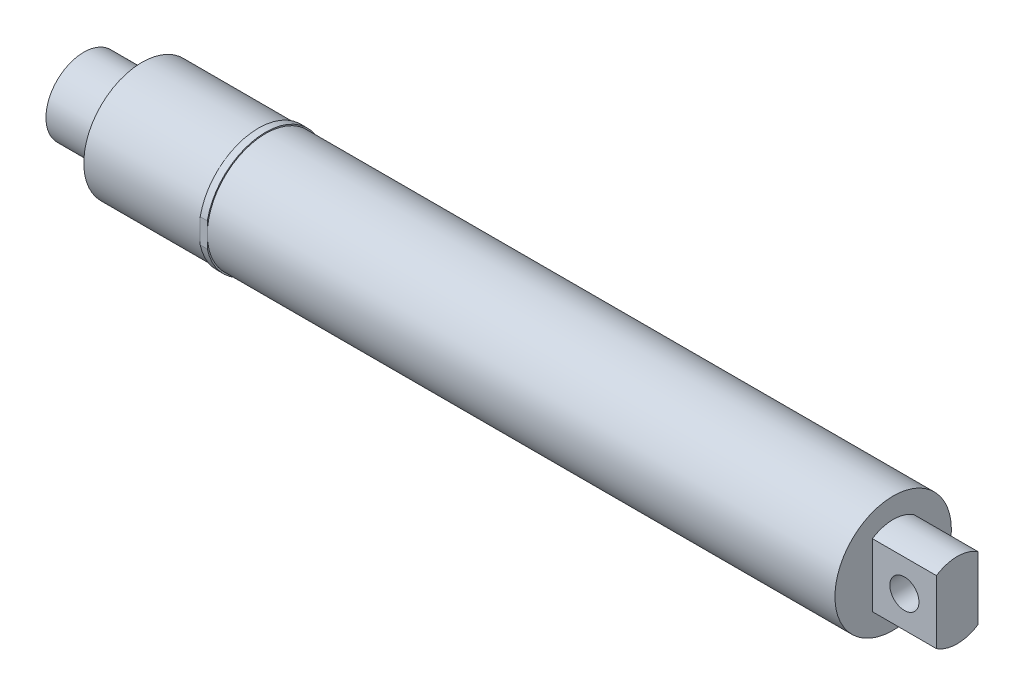
ISO-10303-21;
HEADER;
FILE_DESCRIPTION(('STEP AP214'),'2;1');
FILE_NAME('part.step','',(''),(''),'','','');
FILE_SCHEMA(('AUTOMOTIVE_DESIGN { 1 0 10303 214 1 1 1 1 }'));
ENDSEC;
DATA;
#1=APPLICATION_CONTEXT('core data for automotive mechanical design processes');
#2=APPLICATION_PROTOCOL_DEFINITION('international standard','automotive_design',2000,#1);
#3=PRODUCT_CONTEXT('',#1,'mechanical');
#4=PRODUCT('Part','Part','',(#3));
#5=PRODUCT_RELATED_PRODUCT_CATEGORY('part','',(#4));
#6=PRODUCT_DEFINITION_FORMATION('','',#4);
#7=PRODUCT_DEFINITION_CONTEXT('part definition',#1,'design');
#8=PRODUCT_DEFINITION('design','',#6,#7);
#9=PRODUCT_DEFINITION_SHAPE('','',#8);
#10=(LENGTH_UNIT() NAMED_UNIT(*) SI_UNIT(.MILLI.,.METRE.));
#11=(NAMED_UNIT(*) PLANE_ANGLE_UNIT() SI_UNIT($,.RADIAN.));
#12=(NAMED_UNIT(*) SI_UNIT($,.STERADIAN.) SOLID_ANGLE_UNIT());
#13=UNCERTAINTY_MEASURE_WITH_UNIT(LENGTH_MEASURE(1.E-05),#10,'distance_accuracy_value','');
#14=(GEOMETRIC_REPRESENTATION_CONTEXT(3) GLOBAL_UNCERTAINTY_ASSIGNED_CONTEXT((#13)) GLOBAL_UNIT_ASSIGNED_CONTEXT((#10,
#11,#12)) REPRESENTATION_CONTEXT('',''));
#15=CARTESIAN_POINT('',(0.,0.,0.));
#16=DIRECTION('',(0.,0.,1.));
#17=DIRECTION('',(1.,0.,0.));
#18=AXIS2_PLACEMENT_3D('',#15,#16,#17);
#19=CARTESIAN_POINT('',(0.,0.,12.7));
#20=DIRECTION('',(0.,0.,1.));
#21=DIRECTION('',(1.,0.,0.));
#22=AXIS2_PLACEMENT_3D('',#19,#20,#21);
#23=PLANE('',#22);
#24=DIRECTION('',(-1.,0.,0.));
#25=VECTOR('',#24,1.);
#26=CARTESIAN_POINT('',(102.362,-2.76845740193436,12.7));
#27=LINE('',#26,#25);
#28=CARTESIAN_POINT('',(39.6461242950851,-2.76845740193436,12.7));
#29=VERTEX_POINT('',#28);
#30=CARTESIAN_POINT('',(38.1,-2.76845740193436,12.7));
#31=VERTEX_POINT('',#30);
#32=EDGE_CURVE('E57',#29,#31,#27,.T.);
#33=ORIENTED_EDGE('',*,*,#32,.F.);
#34=DIRECTION('',(0.,1.,0.));
#35=VECTOR('',#34,1.);
#36=CARTESIAN_POINT('',(39.6461242950851,-12.4409828948511,12.7));
#37=LINE('',#36,#35);
#38=CARTESIAN_POINT('',(39.6461242950851,0.,12.7));
#39=VERTEX_POINT('',#38);
#40=EDGE_CURVE('E269',#29,#39,#37,.T.);
#41=ORIENTED_EDGE('',*,*,#40,.T.);
#42=CARTESIAN_POINT('',(39.6461242950851,2.57800782224224,12.7));
#43=VERTEX_POINT('',#42);
#44=EDGE_CURVE('E264',#39,#43,#37,.T.);
#45=ORIENTED_EDGE('',*,*,#44,.T.);
#46=DIRECTION('',(-1.,0.,0.));
#47=VECTOR('',#46,1.);
#48=CARTESIAN_POINT('',(64.262,2.57800782224224,12.7));
#49=LINE('',#48,#47);
#50=CARTESIAN_POINT('',(38.1,2.57800782224224,12.7));
#51=VERTEX_POINT('',#50);
#52=EDGE_CURVE('E288',#43,#51,#49,.T.);
#53=ORIENTED_EDGE('',*,*,#52,.T.);
#54=DIRECTION('',(0.,-1.,0.));
#55=VECTOR('',#54,1.);
#56=CARTESIAN_POINT('',(38.1,-12.4409828948511,12.7));
#57=LINE('',#56,#55);
#58=CARTESIAN_POINT('',(38.1,0.,12.7));
#59=VERTEX_POINT('',#58);
#60=EDGE_CURVE('E252',#51,#59,#57,.T.);
#61=ORIENTED_EDGE('',*,*,#60,.T.);
#62=EDGE_CURVE('E248',#59,#31,#57,.T.);
#63=ORIENTED_EDGE('',*,*,#62,.T.);
#64=EDGE_LOOP('',(#33,#41,#45,#53,#61,#63));
#65=FACE_BOUND('',#64,.T.);
#66=ADVANCED_FACE('F33',(#65),#23,.T.);
#67=CARTESIAN_POINT('',(39.6461242950851,-12.4409828948511,12.7));
#68=DIRECTION('',(-1.,0.,0.));
#69=DIRECTION('',(0.,0.,1.));
#70=AXIS2_PLACEMENT_3D('',#67,#68,#69);
#71=PLANE('',#70);
#72=DIRECTION('',(0.,1.,0.));
#73=VECTOR('',#72,1.);
#74=CARTESIAN_POINT('',(39.6461242950851,-12.4409828948511,-12.7));
#75=LINE('',#74,#73);
#76=CARTESIAN_POINT('',(39.6461242950851,0.,-12.7));
#77=VERTEX_POINT('',#76);
#78=CARTESIAN_POINT('',(39.6461242950851,2.57800782224224,-12.7));
#79=VERTEX_POINT('',#78);
#80=EDGE_CURVE('E265',#77,#79,#75,.T.);
#81=ORIENTED_EDGE('',*,*,#80,.T.);
#82=CARTESIAN_POINT('',(39.6461242950851,0.,0.));
#83=DIRECTION('',(-1.,0.,0.));
#84=DIRECTION('',(0.,0.,1.));
#85=AXIS2_PLACEMENT_3D('',#82,#83,#84);
#86=CIRCLE('',#85,12.9590171051489);
#87=EDGE_CURVE('E287',#43,#79,#86,.T.);
#88=ORIENTED_EDGE('',*,*,#87,.F.);
#89=ORIENTED_EDGE('',*,*,#44,.F.);
#90=CARTESIAN_POINT('',(39.6461242950851,0.,0.));
#91=DIRECTION('',(-1.,0.,0.));
#92=DIRECTION('',(0.,0.,1.));
#93=AXIS2_PLACEMENT_3D('',#90,#91,#92);
#94=CIRCLE('',#93,12.7);
#95=EDGE_CURVE('E169',#39,#77,#94,.T.);
#96=ORIENTED_EDGE('',*,*,#95,.T.);
#97=EDGE_LOOP('',(#81,#88,#89,#96));
#98=FACE_BOUND('',#97,.T.);
#99=ADVANCED_FACE('F285',(#98),#71,.F.);
#100=CARTESIAN_POINT('',(38.1,-12.4409828948511,12.7));
#101=DIRECTION('',(1.,0.,0.));
#102=DIRECTION('',(0.,0.,-1.));
#103=AXIS2_PLACEMENT_3D('',#100,#101,#102);
#104=PLANE('',#103);
#105=CARTESIAN_POINT('',(38.1,0.,0.));
#106=DIRECTION('',(1.,0.,0.));
#107=DIRECTION('',(0.,0.,-1.));
#108=AXIS2_PLACEMENT_3D('',#105,#106,#107);
#109=CIRCLE('',#108,12.9590171051489);
#110=CARTESIAN_POINT('',(38.1,2.57800782224224,-12.7));
#111=VERTEX_POINT('',#110);
#112=EDGE_CURVE('E290',#111,#51,#109,.T.);
#113=ORIENTED_EDGE('',*,*,#112,.F.);
#114=DIRECTION('',(0.,-1.,0.));
#115=VECTOR('',#114,1.);
#116=CARTESIAN_POINT('',(38.1,-12.4409828948511,-12.7));
#117=LINE('',#116,#115);
#118=CARTESIAN_POINT('',(38.1,0.,-12.7));
#119=VERTEX_POINT('',#118);
#120=EDGE_CURVE('E254',#111,#119,#117,.T.);
#121=ORIENTED_EDGE('',*,*,#120,.T.);
#122=CARTESIAN_POINT('',(38.1,0.,0.));
#123=DIRECTION('',(1.,0.,0.));
#124=DIRECTION('',(0.,0.,-1.));
#125=AXIS2_PLACEMENT_3D('',#122,#123,#124);
#126=CIRCLE('',#125,12.7);
#127=EDGE_CURVE('E164',#119,#59,#126,.T.);
#128=ORIENTED_EDGE('',*,*,#127,.T.);
#129=ORIENTED_EDGE('',*,*,#60,.F.);
#130=EDGE_LOOP('',(#113,#121,#128,#129));
#131=FACE_BOUND('',#130,.T.);
#132=ADVANCED_FACE('F251',(#131),#104,.F.);
#133=CARTESIAN_POINT('',(190.5,0.,0.));
#134=DIRECTION('',(-1.,0.,0.));
#135=DIRECTION('',(0.,0.,1.));
#136=AXIS2_PLACEMENT_3D('',#133,#134,#135);
#137=CYLINDRICAL_SURFACE('',#136,12.7);
#138=CARTESIAN_POINT('',(176.53,0.,0.));
#139=DIRECTION('',(1.,0.,0.));
#140=DIRECTION('',(0.,0.,-1.));
#141=AXIS2_PLACEMENT_3D('',#138,#139,#140);
#142=CIRCLE('',#141,12.7);
#143=CARTESIAN_POINT('',(176.53,0.,-12.7));
#144=VERTEX_POINT('',#143);
#145=EDGE_CURVE('E196',#144,#144,#142,.T.);
#146=ORIENTED_EDGE('',*,*,#145,.F.);
#147=EDGE_LOOP('',(#146));
#148=FACE_BOUND('',#147,.T.);
#149=CARTESIAN_POINT('',(12.7,0.,0.));
#150=DIRECTION('',(1.,0.,0.));
#151=DIRECTION('',(0.,0.,-1.));
#152=AXIS2_PLACEMENT_3D('',#149,#150,#151);
#153=CIRCLE('',#152,12.7);
#154=CARTESIAN_POINT('',(12.7,0.,-12.7));
#155=VERTEX_POINT('',#154);
#156=EDGE_CURVE('E211',#155,#155,#153,.T.);
#157=ORIENTED_EDGE('',*,*,#156,.T.);
#158=EDGE_LOOP('',(#157));
#159=FACE_BOUND('',#158,.T.);
#160=ORIENTED_EDGE('',*,*,#95,.F.);
#161=CARTESIAN_POINT('',(39.6461242950851,-12.4409828948511,2.5518512123599));
#162=VERTEX_POINT('',#161);
#163=EDGE_CURVE('E166',#162,#39,#94,.T.);
#164=ORIENTED_EDGE('',*,*,#163,.F.);
#165=DIRECTION('',(-1.,0.,0.));
#166=VECTOR('',#165,1.);
#167=CARTESIAN_POINT('',(190.5,-12.4409828948511,2.5518512123599));
#168=LINE('',#167,#166);
#169=CARTESIAN_POINT('',(38.1,-12.4409828948511,2.5518512123599));
#170=VERTEX_POINT('',#169);
#171=EDGE_CURVE('E42',#170,#162,#168,.F.);
#172=ORIENTED_EDGE('',*,*,#171,.F.);
#173=EDGE_CURVE('E165',#59,#170,#126,.T.);
#174=ORIENTED_EDGE('',*,*,#173,.F.);
#175=ORIENTED_EDGE('',*,*,#127,.F.);
#176=CARTESIAN_POINT('',(38.1,-12.4409828948511,-2.5518512123599));
#177=VERTEX_POINT('',#176);
#178=EDGE_CURVE('E158',#177,#119,#126,.T.);
#179=ORIENTED_EDGE('',*,*,#178,.F.);
#180=DIRECTION('',(-1.,0.,0.));
#181=VECTOR('',#180,1.);
#182=CARTESIAN_POINT('',(190.5,-12.4409828948511,-2.5518512123599));
#183=LINE('',#182,#181);
#184=CARTESIAN_POINT('',(39.6461242950851,-12.4409828948511,-2.5518512123599));
#185=VERTEX_POINT('',#184);
#186=EDGE_CURVE('E229',#185,#177,#183,.T.);
#187=ORIENTED_EDGE('',*,*,#186,.F.);
#188=EDGE_CURVE('E154',#77,#185,#94,.T.);
#189=ORIENTED_EDGE('',*,*,#188,.F.);
#190=EDGE_LOOP('',(#160,#164,#172,#174,#175,#179,#187,#189));
#191=FACE_BOUND('',#190,.T.);
#192=ADVANCED_FACE('F35',(#148,#159,#191),#137,.T.);
#193=CARTESIAN_POINT('',(170.18,0.,0.));
#194=DIRECTION('',(-1.,0.,0.));
#195=DIRECTION('',(0.,0.,1.));
#196=AXIS2_PLACEMENT_3D('',#193,#194,#195);
#197=CYLINDRICAL_SURFACE('',#196,2.54);
#198=CARTESIAN_POINT('',(0.,0.,0.));
#199=DIRECTION('',(-1.,0.,0.));
#200=DIRECTION('',(0.,0.,1.));
#201=AXIS2_PLACEMENT_3D('',#198,#199,#200);
#202=CIRCLE('',#201,2.54);
#203=CARTESIAN_POINT('',(0.,0.,2.54));
#204=VERTEX_POINT('',#203);
#205=EDGE_CURVE('E204',#204,#204,#202,.T.);
#206=ORIENTED_EDGE('',*,*,#205,.T.);
#207=EDGE_LOOP('',(#206));
#208=FACE_BOUND('',#207,.T.);
#209=CARTESIAN_POINT('',(38.1,0.,0.));
#210=DIRECTION('',(1.,0.,0.));
#211=DIRECTION('',(0.,0.,-1.));
#212=AXIS2_PLACEMENT_3D('',#209,#210,#211);
#213=CIRCLE('',#212,2.54);
#214=CARTESIAN_POINT('',(38.1,0.,-2.54));
#215=VERTEX_POINT('',#214);
#216=EDGE_CURVE('E223',#215,#215,#213,.F.);
#217=ORIENTED_EDGE('',*,*,#216,.F.);
#218=EDGE_LOOP('',(#217));
#219=FACE_BOUND('',#218,.T.);
#220=ADVANCED_FACE('F353',(#208,#219),#197,.F.);
#221=CARTESIAN_POINT('',(176.53,0.,0.));
#222=DIRECTION('',(1.,0.,0.));
#223=DIRECTION('',(0.,0.,-1.));
#224=AXIS2_PLACEMENT_3D('',#221,#222,#223);
#225=CYLINDRICAL_SURFACE('',#224,8.255);
#226=DIRECTION('',(1.,0.,0.));
#227=VECTOR('',#226,1.);
#228=CARTESIAN_POINT('',(176.53,-6.89903867691182,-4.53302220758675));
#229=LINE('',#228,#227);
#230=CARTESIAN_POINT('',(176.53,-6.89903867691182,-4.53302220758675));
#231=VERTEX_POINT('',#230);
#232=CARTESIAN_POINT('',(190.5,-6.89903867691182,-4.53302220758675));
#233=VERTEX_POINT('',#232);
#234=EDGE_CURVE('E180',#231,#233,#229,.T.);
#235=ORIENTED_EDGE('',*,*,#234,.T.);
#236=CARTESIAN_POINT('',(190.5,0.,0.));
#237=DIRECTION('',(1.,0.,0.));
#238=DIRECTION('',(0.,0.,-1.));
#239=AXIS2_PLACEMENT_3D('',#236,#237,#238);
#240=CIRCLE('',#239,8.255);
#241=CARTESIAN_POINT('',(190.5,-6.89903867691183,4.53302220758675));
#242=VERTEX_POINT('',#241);
#243=EDGE_CURVE('E207',#242,#233,#240,.T.);
#244=ORIENTED_EDGE('',*,*,#243,.F.);
#245=DIRECTION('',(1.,0.,0.));
#246=VECTOR('',#245,1.);
#247=CARTESIAN_POINT('',(176.53,-6.89903867691183,4.53302220758675));
#248=LINE('',#247,#246);
#249=CARTESIAN_POINT('',(176.53,-6.89903867691183,4.53302220758675));
#250=VERTEX_POINT('',#249);
#251=EDGE_CURVE('E187',#250,#242,#248,.T.);
#252=ORIENTED_EDGE('',*,*,#251,.F.);
#253=CARTESIAN_POINT('',(176.53,0.,0.));
#254=DIRECTION('',(1.,0.,0.));
#255=DIRECTION('',(0.,0.,-1.));
#256=AXIS2_PLACEMENT_3D('',#253,#254,#255);
#257=CIRCLE('',#256,8.255);
#258=EDGE_CURVE('E193',#250,#231,#257,.T.);
#259=ORIENTED_EDGE('',*,*,#258,.T.);
#260=EDGE_LOOP('',(#235,#244,#252,#259));
#261=FACE_BOUND('',#260,.T.);
#262=ADVANCED_FACE('F339',(#261),#225,.T.);
#263=CARTESIAN_POINT('',(12.7,0.,0.));
#264=DIRECTION('',(1.,0.,0.));
#265=DIRECTION('',(0.,0.,-1.));
#266=AXIS2_PLACEMENT_3D('',#263,#264,#265);
#267=PLANE('',#266);
#268=ORIENTED_EDGE('',*,*,#156,.F.);
#269=EDGE_LOOP('',(#268));
#270=FACE_BOUND('',#269,.T.);
#271=CARTESIAN_POINT('',(12.7,0.,0.));
#272=DIRECTION('',(1.,0.,0.));
#273=DIRECTION('',(0.,0.,-1.));
#274=AXIS2_PLACEMENT_3D('',#271,#272,#273);
#275=CIRCLE('',#274,8.255);
#276=CARTESIAN_POINT('',(12.7,0.,-8.255));
#277=VERTEX_POINT('',#276);
#278=EDGE_CURVE('E208',#277,#277,#275,.T.);
#279=ORIENTED_EDGE('',*,*,#278,.T.);
#280=EDGE_LOOP('',(#279));
#281=FACE_BOUND('',#280,.T.);
#282=ADVANCED_FACE('F357',(#270,#281),#267,.F.);
#283=CARTESIAN_POINT('',(12.7,0.,0.));
#284=DIRECTION('',(-1.,0.,0.));
#285=DIRECTION('',(0.,0.,1.));
#286=AXIS2_PLACEMENT_3D('',#283,#284,#285);
#287=CYLINDRICAL_SURFACE('',#286,8.255);
#288=ORIENTED_EDGE('',*,*,#278,.F.);
#289=EDGE_LOOP('',(#288));
#290=FACE_BOUND('',#289,.T.);
#291=CARTESIAN_POINT('',(0.,0.,0.));
#292=DIRECTION('',(1.,0.,0.));
#293=DIRECTION('',(0.,0.,-1.));
#294=AXIS2_PLACEMENT_3D('',#291,#292,#293);
#295=CIRCLE('',#294,8.255);
#296=CARTESIAN_POINT('',(0.,0.,-8.255));
#297=VERTEX_POINT('',#296);
#298=EDGE_CURVE('E203',#297,#297,#295,.T.);
#299=ORIENTED_EDGE('',*,*,#298,.T.);
#300=EDGE_LOOP('',(#299));
#301=FACE_BOUND('',#300,.T.);
#302=ADVANCED_FACE('F354',(#290,#301),#287,.T.);
#303=CARTESIAN_POINT('',(0.,0.,0.));
#304=DIRECTION('',(1.,0.,0.));
#305=DIRECTION('',(0.,0.,-1.));
#306=AXIS2_PLACEMENT_3D('',#303,#304,#305);
#307=PLANE('',#306);
#308=ORIENTED_EDGE('',*,*,#205,.F.);
#309=EDGE_LOOP('',(#308));
#310=FACE_BOUND('',#309,.T.);
#311=ORIENTED_EDGE('',*,*,#298,.F.);
#312=EDGE_LOOP('',(#311));
#313=FACE_BOUND('',#312,.T.);
#314=ADVANCED_FACE('F342',(#310,#313),#307,.F.);
#315=CARTESIAN_POINT('',(176.53,0.,0.));
#316=DIRECTION('',(1.,0.,0.));
#317=DIRECTION('',(0.,0.,-1.));
#318=AXIS2_PLACEMENT_3D('',#315,#316,#317);
#319=PLANE('',#318);
#320=ORIENTED_EDGE('',*,*,#258,.F.);
#321=DIRECTION('',(0.,1.,0.));
#322=VECTOR('',#321,1.);
#323=CARTESIAN_POINT('',(176.53,6.89903867691184,4.53302220758674));
#324=LINE('',#323,#322);
#325=CARTESIAN_POINT('',(176.53,6.89903867691184,4.53302220758674));
#326=VERTEX_POINT('',#325);
#327=EDGE_CURVE('E183',#250,#326,#324,.T.);
#328=ORIENTED_EDGE('',*,*,#327,.T.);
#329=CARTESIAN_POINT('',(176.53,6.89903867691183,-4.53302220758674));
#330=VERTEX_POINT('',#329);
#331=EDGE_CURVE('E191',#330,#326,#257,.T.);
#332=ORIENTED_EDGE('',*,*,#331,.F.);
#333=DIRECTION('',(0.,-1.,0.));
#334=VECTOR('',#333,1.);
#335=CARTESIAN_POINT('',(176.53,6.89903867691183,-4.53302220758674));
#336=LINE('',#335,#334);
#337=EDGE_CURVE('E176',#330,#231,#336,.T.);
#338=ORIENTED_EDGE('',*,*,#337,.T.);
#339=EDGE_LOOP('',(#320,#328,#332,#338));
#340=FACE_BOUND('',#339,.T.);
#341=ORIENTED_EDGE('',*,*,#145,.T.);
#342=EDGE_LOOP('',(#341));
#343=FACE_BOUND('',#342,.T.);
#344=ADVANCED_FACE('F337',(#340,#343),#319,.T.);
#345=DIRECTION('',(1.,0.,0.));
#346=VECTOR('',#345,1.);
#347=CARTESIAN_POINT('',(176.53,6.89903867691183,-4.53302220758674));
#348=LINE('',#347,#346);
#349=CARTESIAN_POINT('',(190.5,6.89903867691184,-4.53302220758674));
#350=VERTEX_POINT('',#349);
#351=EDGE_CURVE('E179',#330,#350,#348,.T.);
#352=ORIENTED_EDGE('',*,*,#351,.F.);
#353=ORIENTED_EDGE('',*,*,#331,.T.);
#354=DIRECTION('',(1.,0.,0.));
#355=VECTOR('',#354,1.);
#356=CARTESIAN_POINT('',(176.53,6.89903867691184,4.53302220758674));
#357=LINE('',#356,#355);
#358=CARTESIAN_POINT('',(190.5,6.89903867691184,4.53302220758674));
#359=VERTEX_POINT('',#358);
#360=EDGE_CURVE('E188',#326,#359,#357,.T.);
#361=ORIENTED_EDGE('',*,*,#360,.T.);
#362=EDGE_CURVE('E199',#350,#359,#240,.T.);
#363=ORIENTED_EDGE('',*,*,#362,.F.);
#364=EDGE_LOOP('',(#352,#353,#361,#363));
#365=FACE_BOUND('',#364,.T.);
#366=ADVANCED_FACE('F334',(#365),#225,.T.);
#367=CARTESIAN_POINT('',(190.5,0.,0.));
#368=DIRECTION('',(1.,0.,0.));
#369=DIRECTION('',(0.,0.,-1.));
#370=AXIS2_PLACEMENT_3D('',#367,#368,#369);
#371=PLANE('',#370);
#372=DIRECTION('',(0.,-1.,0.));
#373=VECTOR('',#372,1.);
#374=CARTESIAN_POINT('',(190.5,0.,-4.53302220758675));
#375=LINE('',#374,#373);
#376=EDGE_CURVE('E221',#350,#233,#375,.T.);
#377=ORIENTED_EDGE('',*,*,#376,.F.);
#378=ORIENTED_EDGE('',*,*,#362,.T.);
#379=DIRECTION('',(0.,1.,0.));
#380=VECTOR('',#379,1.);
#381=CARTESIAN_POINT('',(190.5,0.,4.53302220758675));
#382=LINE('',#381,#380);
#383=EDGE_CURVE('E216',#242,#359,#382,.T.);
#384=ORIENTED_EDGE('',*,*,#383,.F.);
#385=ORIENTED_EDGE('',*,*,#243,.T.);
#386=EDGE_LOOP('',(#377,#378,#384,#385));
#387=FACE_BOUND('',#386,.T.);
#388=ADVANCED_FACE('F332',(#387),#371,.T.);
#389=CARTESIAN_POINT('',(176.53,6.89903867691184,4.53302220758674));
#390=DIRECTION('',(0.,0.,-1.));
#391=DIRECTION('',(0.,1.,0.));
#392=AXIS2_PLACEMENT_3D('',#389,#390,#391);
#393=PLANE('',#392);
#394=CARTESIAN_POINT('',(183.515,0.,4.53302220758675));
#395=DIRECTION('',(0.,0.,-1.));
#396=DIRECTION('',(0.,1.,0.));
#397=AXIS2_PLACEMENT_3D('',#394,#395,#396);
#398=CIRCLE('',#397,3.175);
#399=CARTESIAN_POINT('',(183.515,3.175,4.53302220758675));
#400=VERTEX_POINT('',#399);
#401=EDGE_CURVE('E173',#400,#400,#398,.T.);
#402=ORIENTED_EDGE('',*,*,#401,.T.);
#403=EDGE_LOOP('',(#402));
#404=FACE_BOUND('',#403,.T.);
#405=ORIENTED_EDGE('',*,*,#383,.T.);
#406=ORIENTED_EDGE('',*,*,#360,.F.);
#407=ORIENTED_EDGE('',*,*,#327,.F.);
#408=ORIENTED_EDGE('',*,*,#251,.T.);
#409=EDGE_LOOP('',(#405,#406,#407,#408));
#410=FACE_BOUND('',#409,.T.);
#411=ADVANCED_FACE('F328',(#404,#410),#393,.F.);
#412=CARTESIAN_POINT('',(176.53,6.89903867691183,-4.53302220758674));
#413=DIRECTION('',(0.,0.,1.));
#414=DIRECTION('',(0.,-1.,0.));
#415=AXIS2_PLACEMENT_3D('',#412,#413,#414);
#416=PLANE('',#415);
#417=CARTESIAN_POINT('',(183.515,0.,-4.53302220758675));
#418=DIRECTION('',(0.,0.,-1.));
#419=DIRECTION('',(0.,1.,0.));
#420=AXIS2_PLACEMENT_3D('',#417,#418,#419);
#421=CIRCLE('',#420,3.175);
#422=CARTESIAN_POINT('',(183.515,3.175,-4.53302220758675));
#423=VERTEX_POINT('',#422);
#424=EDGE_CURVE('E170',#423,#423,#421,.T.);
#425=ORIENTED_EDGE('',*,*,#424,.F.);
#426=EDGE_LOOP('',(#425));
#427=FACE_BOUND('',#426,.T.);
#428=ORIENTED_EDGE('',*,*,#376,.T.);
#429=ORIENTED_EDGE('',*,*,#234,.F.);
#430=ORIENTED_EDGE('',*,*,#337,.F.);
#431=ORIENTED_EDGE('',*,*,#351,.T.);
#432=EDGE_LOOP('',(#428,#429,#430,#431));
#433=FACE_BOUND('',#432,.T.);
#434=ADVANCED_FACE('F324',(#427,#433),#416,.F.);
#435=CARTESIAN_POINT('',(183.515,0.,11.9769777924133));
#436=DIRECTION('',(0.,0.,-1.));
#437=DIRECTION('',(0.,1.,0.));
#438=AXIS2_PLACEMENT_3D('',#435,#436,#437);
#439=CYLINDRICAL_SURFACE('',#438,3.175);
#440=ORIENTED_EDGE('',*,*,#424,.T.);
#441=EDGE_LOOP('',(#440));
#442=FACE_BOUND('',#441,.T.);
#443=ORIENTED_EDGE('',*,*,#401,.F.);
#444=EDGE_LOOP('',(#443));
#445=FACE_BOUND('',#444,.T.);
#446=ADVANCED_FACE('F321',(#442,#445),#439,.F.);
#447=ORIENTED_EDGE('',*,*,#216,.T.);
#448=EDGE_LOOP('',(#447));
#449=FACE_BOUND('',#448,.T.);
#450=ADVANCED_FACE('F307',(#449),#104,.F.);
#451=CARTESIAN_POINT('',(38.1,-12.4409828948511,12.7));
#452=DIRECTION('',(0.,1.,0.));
#453=DIRECTION('',(0.,0.,1.));
#454=AXIS2_PLACEMENT_3D('',#451,#452,#453);
#455=PLANE('',#454);
#456=DIRECTION('',(0.,0.,-1.));
#457=VECTOR('',#456,1.);
#458=CARTESIAN_POINT('',(38.1,-12.4409828948511,12.7));
#459=LINE('',#458,#457);
#460=CARTESIAN_POINT('',(38.1,-12.4409828948511,-3.76514289188975));
#461=VERTEX_POINT('',#460);
#462=EDGE_CURVE('E148',#177,#461,#459,.T.);
#463=ORIENTED_EDGE('',*,*,#462,.T.);
#464=DIRECTION('',(-1.,0.,0.));
#465=VECTOR('',#464,1.);
#466=CARTESIAN_POINT('',(102.362,-12.4409828948511,-3.76514289188975));
#467=LINE('',#466,#465);
#468=CARTESIAN_POINT('',(39.6461242950851,-12.4409828948511,-3.76514289188975));
#469=VERTEX_POINT('',#468);
#470=EDGE_CURVE('E49',#469,#461,#467,.T.);
#471=ORIENTED_EDGE('',*,*,#470,.F.);
#472=DIRECTION('',(0.,0.,-1.));
#473=VECTOR('',#472,1.);
#474=CARTESIAN_POINT('',(39.6461242950851,-12.4409828948511,12.7));
#475=LINE('',#474,#473);
#476=EDGE_CURVE('E146',#185,#469,#475,.T.);
#477=ORIENTED_EDGE('',*,*,#476,.F.);
#478=ORIENTED_EDGE('',*,*,#186,.T.);
#479=EDGE_LOOP('',(#463,#471,#477,#478));
#480=FACE_BOUND('',#479,.T.);
#481=ADVANCED_FACE('F144',(#480),#455,.F.);
#482=CARTESIAN_POINT('',(39.6461242950851,-12.4409828948511,3.76514289188975));
#483=VERTEX_POINT('',#482);
#484=EDGE_CURVE('E155',#483,#162,#475,.T.);
#485=ORIENTED_EDGE('',*,*,#484,.F.);
#486=DIRECTION('',(-1.,0.,0.));
#487=VECTOR('',#486,1.);
#488=CARTESIAN_POINT('',(102.362,-12.4409828948511,3.76514289188975));
#489=LINE('',#488,#487);
#490=CARTESIAN_POINT('',(38.1,-12.4409828948511,3.76514289188975));
#491=VERTEX_POINT('',#490);
#492=EDGE_CURVE('E275',#483,#491,#489,.T.);
#493=ORIENTED_EDGE('',*,*,#492,.T.);
#494=EDGE_CURVE('E156',#491,#170,#459,.T.);
#495=ORIENTED_EDGE('',*,*,#494,.T.);
#496=ORIENTED_EDGE('',*,*,#171,.T.);
#497=EDGE_LOOP('',(#485,#493,#495,#496));
#498=FACE_BOUND('',#497,.T.);
#499=ADVANCED_FACE('F234',(#498),#455,.F.);
#500=CARTESIAN_POINT('',(0.,0.,-12.7));
#501=DIRECTION('',(0.,0.,1.));
#502=DIRECTION('',(1.,0.,0.));
#503=AXIS2_PLACEMENT_3D('',#500,#501,#502);
#504=PLANE('',#503);
#505=CARTESIAN_POINT('',(39.6461242950851,-2.76845740193437,-12.7));
#506=VERTEX_POINT('',#505);
#507=EDGE_CURVE('E262',#506,#77,#75,.T.);
#508=ORIENTED_EDGE('',*,*,#507,.F.);
#509=DIRECTION('',(-1.,0.,0.));
#510=VECTOR('',#509,1.);
#511=CARTESIAN_POINT('',(102.362,-2.76845740193437,-12.7));
#512=LINE('',#511,#510);
#513=CARTESIAN_POINT('',(38.1,-2.76845740193437,-12.7));
#514=VERTEX_POINT('',#513);
#515=EDGE_CURVE('E136',#506,#514,#512,.T.);
#516=ORIENTED_EDGE('',*,*,#515,.T.);
#517=EDGE_CURVE('E259',#119,#514,#117,.T.);
#518=ORIENTED_EDGE('',*,*,#517,.F.);
#519=ORIENTED_EDGE('',*,*,#120,.F.);
#520=DIRECTION('',(-1.,0.,0.));
#521=VECTOR('',#520,1.);
#522=CARTESIAN_POINT('',(102.362,2.57800782224223,-12.7));
#523=LINE('',#522,#521);
#524=EDGE_CURVE('E11',#111,#79,#523,.F.);
#525=ORIENTED_EDGE('',*,*,#524,.T.);
#526=ORIENTED_EDGE('',*,*,#80,.F.);
#527=EDGE_LOOP('',(#508,#516,#518,#519,#525,#526));
#528=FACE_BOUND('',#527,.T.);
#529=ADVANCED_FACE('F261',(#528),#504,.F.);
#530=ORIENTED_EDGE('',*,*,#476,.T.);
#531=CARTESIAN_POINT('',(39.6461242950851,0.,0.));
#532=DIRECTION('',(-1.,0.,0.));
#533=DIRECTION('',(0.,0.,1.));
#534=AXIS2_PLACEMENT_3D('',#531,#532,#533);
#535=CIRCLE('',#534,12.9982443578479);
#536=EDGE_CURVE('E133',#469,#506,#535,.F.);
#537=ORIENTED_EDGE('',*,*,#536,.T.);
#538=ORIENTED_EDGE('',*,*,#507,.T.);
#539=ORIENTED_EDGE('',*,*,#188,.T.);
#540=EDGE_LOOP('',(#530,#537,#538,#539));
#541=FACE_BOUND('',#540,.T.);
#542=ADVANCED_FACE('F152',(#541),#71,.F.);
#543=ORIENTED_EDGE('',*,*,#40,.F.);
#544=CARTESIAN_POINT('',(39.6461242950851,0.,0.));
#545=DIRECTION('',(-1.,0.,0.));
#546=DIRECTION('',(0.,0.,1.));
#547=AXIS2_PLACEMENT_3D('',#544,#545,#546);
#548=CIRCLE('',#547,12.9982443578479);
#549=EDGE_CURVE('E274',#29,#483,#548,.F.);
#550=ORIENTED_EDGE('',*,*,#549,.T.);
#551=ORIENTED_EDGE('',*,*,#484,.T.);
#552=ORIENTED_EDGE('',*,*,#163,.T.);
#553=EDGE_LOOP('',(#543,#550,#551,#552));
#554=FACE_BOUND('',#553,.T.);
#555=ADVANCED_FACE('F279',(#554),#71,.F.);
#556=ORIENTED_EDGE('',*,*,#494,.F.);
#557=CARTESIAN_POINT('',(38.1,0.,0.));
#558=DIRECTION('',(1.,0.,0.));
#559=DIRECTION('',(0.,0.,-1.));
#560=AXIS2_PLACEMENT_3D('',#557,#558,#559);
#561=CIRCLE('',#560,12.9982443578479);
#562=EDGE_CURVE('E586',#31,#491,#561,.T.);
#563=ORIENTED_EDGE('',*,*,#562,.F.);
#564=ORIENTED_EDGE('',*,*,#62,.F.);
#565=ORIENTED_EDGE('',*,*,#173,.T.);
#566=EDGE_LOOP('',(#556,#563,#564,#565));
#567=FACE_BOUND('',#566,.T.);
#568=ADVANCED_FACE('F246',(#567),#104,.F.);
#569=ORIENTED_EDGE('',*,*,#517,.T.);
#570=CARTESIAN_POINT('',(38.1,0.,0.));
#571=DIRECTION('',(1.,0.,0.));
#572=DIRECTION('',(0.,0.,-1.));
#573=AXIS2_PLACEMENT_3D('',#570,#571,#572);
#574=CIRCLE('',#573,12.9982443578479);
#575=EDGE_CURVE('E149',#461,#514,#574,.T.);
#576=ORIENTED_EDGE('',*,*,#575,.F.);
#577=ORIENTED_EDGE('',*,*,#462,.F.);
#578=ORIENTED_EDGE('',*,*,#178,.T.);
#579=EDGE_LOOP('',(#569,#576,#577,#578));
#580=FACE_BOUND('',#579,.T.);
#581=ADVANCED_FACE('F258',(#580),#104,.F.);
#582=CARTESIAN_POINT('',(64.262,0.,0.));
#583=DIRECTION('',(-1.,0.,0.));
#584=DIRECTION('',(0.,0.,1.));
#585=AXIS2_PLACEMENT_3D('',#582,#583,#584);
#586=CYLINDRICAL_SURFACE('',#585,12.9590171051489);
#587=ORIENTED_EDGE('',*,*,#87,.T.);
#588=ORIENTED_EDGE('',*,*,#524,.F.);
#589=ORIENTED_EDGE('',*,*,#112,.T.);
#590=ORIENTED_EDGE('',*,*,#52,.F.);
#591=EDGE_LOOP('',(#587,#588,#589,#590));
#592=FACE_BOUND('',#591,.T.);
#593=ADVANCED_FACE('F296',(#592),#586,.T.);
#594=CARTESIAN_POINT('',(102.362,0.,0.));
#595=DIRECTION('',(-1.,0.,0.));
#596=DIRECTION('',(0.,0.,1.));
#597=AXIS2_PLACEMENT_3D('',#594,#595,#596);
#598=CYLINDRICAL_SURFACE('',#597,12.9982443578479);
#599=ORIENTED_EDGE('',*,*,#32,.T.);
#600=ORIENTED_EDGE('',*,*,#562,.T.);
#601=ORIENTED_EDGE('',*,*,#492,.F.);
#602=ORIENTED_EDGE('',*,*,#549,.F.);
#603=EDGE_LOOP('',(#599,#600,#601,#602));
#604=FACE_BOUND('',#603,.T.);
#605=ADVANCED_FACE('F298',(#604),#598,.T.);
#606=CARTESIAN_POINT('',(102.362,0.,0.));
#607=DIRECTION('',(-1.,0.,0.));
#608=DIRECTION('',(0.,0.,1.));
#609=AXIS2_PLACEMENT_3D('',#606,#607,#608);
#610=CYLINDRICAL_SURFACE('',#609,12.9982443578479);
#611=ORIENTED_EDGE('',*,*,#536,.F.);
#612=ORIENTED_EDGE('',*,*,#470,.T.);
#613=ORIENTED_EDGE('',*,*,#575,.T.);
#614=ORIENTED_EDGE('',*,*,#515,.F.);
#615=EDGE_LOOP('',(#611,#612,#613,#614));
#616=FACE_BOUND('',#615,.T.);
#617=ADVANCED_FACE('F134',(#616),#610,.T.);
#618=CLOSED_SHELL('',(#66,#99,#132,#192,#220,#262,#282,#302,#314,#344,#366,#388,#411,#434,#446,
#450,#481,#499,#529,#542,#555,#568,#581,#593,#605,#617));
#619=CARTESIAN_POINT('',(39.6461242950852,0.,0.));
#620=DIRECTION('',(-1.,0.,0.));
#621=DIRECTION('',(0.,0.,1.));
#622=AXIS2_PLACEMENT_3D('',#619,#620,#621);
#623=CIRCLE('',#622,2.54);
#624=CARTESIAN_POINT('',(39.6461242950852,0.,2.54));
#625=VERTEX_POINT('',#624);
#626=EDGE_CURVE('E226',#625,#625,#623,.F.);
#627=ORIENTED_EDGE('',*,*,#626,.T.);
#628=EDGE_LOOP('',(#627));
#629=FACE_BOUND('',#628,.T.);
#630=ADVANCED_FACE('F319',(#629),#71,.F.);
#631=CARTESIAN_POINT('',(170.18,0.,0.));
#632=DIRECTION('',(-1.,0.,0.));
#633=DIRECTION('',(0.,0.,1.));
#634=AXIS2_PLACEMENT_3D('',#631,#632,#633);
#635=PLANE('',#634);
#636=CARTESIAN_POINT('',(170.18,0.,0.));
#637=DIRECTION('',(-1.,0.,0.));
#638=DIRECTION('',(0.,0.,1.));
#639=AXIS2_PLACEMENT_3D('',#636,#637,#638);
#640=CIRCLE('',#639,2.54);
#641=CARTESIAN_POINT('',(170.18,0.,2.54));
#642=VERTEX_POINT('',#641);
#643=EDGE_CURVE('E200',#642,#642,#640,.T.);
#644=ORIENTED_EDGE('',*,*,#643,.T.);
#645=EDGE_LOOP('',(#644));
#646=FACE_BOUND('',#645,.T.);
#647=ADVANCED_FACE('F344',(#646),#635,.T.);
#648=ORIENTED_EDGE('',*,*,#643,.F.);
#649=EDGE_LOOP('',(#648));
#650=FACE_BOUND('',#649,.T.);
#651=ORIENTED_EDGE('',*,*,#626,.F.);
#652=EDGE_LOOP('',(#651));
#653=FACE_BOUND('',#652,.T.);
#654=ADVANCED_FACE('F347',(#650,#653),#197,.F.);
#655=CLOSED_SHELL('',(#630,#647,#654));
#656=ORIENTED_CLOSED_SHELL('',*,#655,.T.);
#657=BREP_WITH_VOIDS('B2',#618,(#656));
#658=ADVANCED_BREP_SHAPE_REPRESENTATION('',(#18,#657),#14);
#659=SHAPE_DEFINITION_REPRESENTATION(#9,#658);
ENDSEC;
END-ISO-10303-21;
